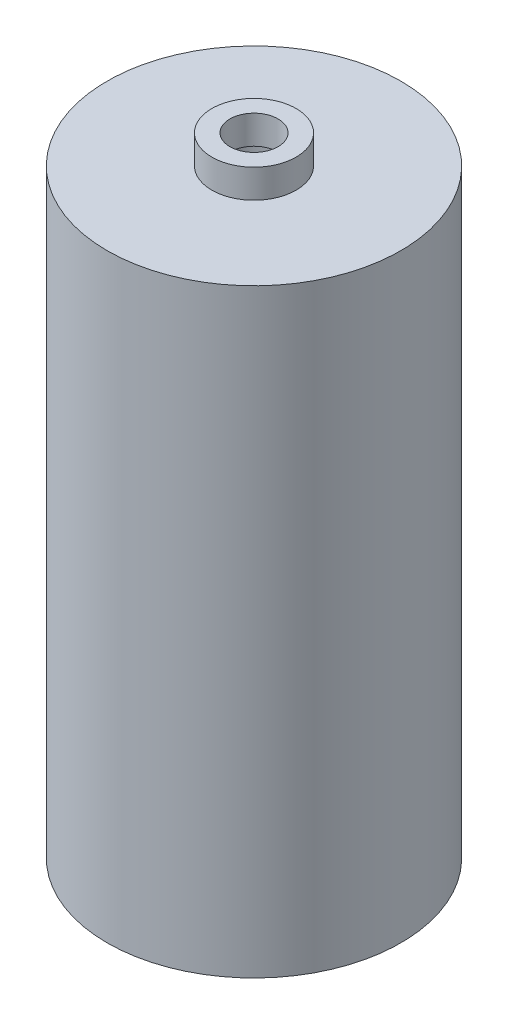
ISO-10303-21;
HEADER;
FILE_DESCRIPTION(('STEP AP214'),'2;1');
FILE_NAME('part.step','',(''),(''),'','','');
FILE_SCHEMA(('AUTOMOTIVE_DESIGN { 1 0 10303 214 1 1 1 1 }'));
ENDSEC;
DATA;
#1=APPLICATION_CONTEXT('core data for automotive mechanical design processes');
#2=APPLICATION_PROTOCOL_DEFINITION('international standard','automotive_design',2000,#1);
#3=PRODUCT_CONTEXT('',#1,'mechanical');
#4=PRODUCT('Part','Part','',(#3));
#5=PRODUCT_RELATED_PRODUCT_CATEGORY('part','',(#4));
#6=PRODUCT_DEFINITION_FORMATION('','',#4);
#7=PRODUCT_DEFINITION_CONTEXT('part definition',#1,'design');
#8=PRODUCT_DEFINITION('design','',#6,#7);
#9=PRODUCT_DEFINITION_SHAPE('','',#8);
#10=(LENGTH_UNIT() NAMED_UNIT(*) SI_UNIT(.MILLI.,.METRE.));
#11=(NAMED_UNIT(*) PLANE_ANGLE_UNIT() SI_UNIT($,.RADIAN.));
#12=(NAMED_UNIT(*) SI_UNIT($,.STERADIAN.) SOLID_ANGLE_UNIT());
#13=UNCERTAINTY_MEASURE_WITH_UNIT(LENGTH_MEASURE(1.E-05),#10,'distance_accuracy_value','');
#14=(GEOMETRIC_REPRESENTATION_CONTEXT(3) GLOBAL_UNCERTAINTY_ASSIGNED_CONTEXT((#13)) GLOBAL_UNIT_ASSIGNED_CONTEXT((#10,
#11,#12)) REPRESENTATION_CONTEXT('',''));
#15=CARTESIAN_POINT('',(0.,0.,0.));
#16=DIRECTION('',(0.,0.,1.));
#17=DIRECTION('',(1.,0.,0.));
#18=AXIS2_PLACEMENT_3D('',#15,#16,#17);
#19=CARTESIAN_POINT('',(0.,49.8,0.));
#20=DIRECTION('',(0.,1.,0.));
#21=DIRECTION('',(0.,0.,1.));
#22=AXIS2_PLACEMENT_3D('',#19,#20,#21);
#23=PLANE('',#22);
#24=CARTESIAN_POINT('',(0.,49.8,0.));
#25=DIRECTION('',(0.,1.,0.));
#26=DIRECTION('',(0.,0.,1.));
#27=AXIS2_PLACEMENT_3D('',#24,#25,#26);
#28=CIRCLE('',#27,3.5);
#29=CARTESIAN_POINT('',(0.,49.8,3.5));
#30=VERTEX_POINT('',#29);
#31=EDGE_CURVE('E72',#30,#30,#28,.T.);
#32=ORIENTED_EDGE('',*,*,#31,.F.);
#33=EDGE_LOOP('',(#32));
#34=FACE_BOUND('',#33,.T.);
#35=CARTESIAN_POINT('',(0.,49.8,0.));
#36=DIRECTION('',(0.,1.,0.));
#37=DIRECTION('',(0.,0.,1.));
#38=AXIS2_PLACEMENT_3D('',#35,#36,#37);
#39=CIRCLE('',#38,12.2);
#40=CARTESIAN_POINT('',(0.,49.8,12.2));
#41=VERTEX_POINT('',#40);
#42=EDGE_CURVE('E11',#41,#41,#39,.T.);
#43=ORIENTED_EDGE('',*,*,#42,.T.);
#44=EDGE_LOOP('',(#43));
#45=FACE_BOUND('',#44,.T.);
#46=ADVANCED_FACE('F49',(#34,#45),#23,.T.);
#47=CARTESIAN_POINT('',(0.,0.,0.));
#48=DIRECTION('',(0.,1.,0.));
#49=DIRECTION('',(0.,0.,1.));
#50=AXIS2_PLACEMENT_3D('',#47,#48,#49);
#51=PLANE('',#50);
#52=CARTESIAN_POINT('',(0.,0.,0.));
#53=DIRECTION('',(0.,1.,0.));
#54=DIRECTION('',(0.,0.,1.));
#55=AXIS2_PLACEMENT_3D('',#52,#53,#54);
#56=CIRCLE('',#55,12.2);
#57=CARTESIAN_POINT('',(0.,0.,12.2));
#58=VERTEX_POINT('',#57);
#59=EDGE_CURVE('E53',#58,#58,#56,.T.);
#60=ORIENTED_EDGE('',*,*,#59,.F.);
#61=EDGE_LOOP('',(#60));
#62=FACE_BOUND('',#61,.T.);
#63=CARTESIAN_POINT('',(0.,0.,0.));
#64=DIRECTION('',(0.,1.,0.));
#65=DIRECTION('',(0.,0.,1.));
#66=AXIS2_PLACEMENT_3D('',#63,#64,#65);
#67=CIRCLE('',#66,3.2);
#68=CARTESIAN_POINT('',(0.,0.,3.2));
#69=VERTEX_POINT('',#68);
#70=EDGE_CURVE('E62',#69,#69,#67,.T.);
#71=ORIENTED_EDGE('',*,*,#70,.T.);
#72=EDGE_LOOP('',(#71));
#73=FACE_BOUND('',#72,.T.);
#74=ADVANCED_FACE('F108',(#62,#73),#51,.F.);
#75=CARTESIAN_POINT('',(0.,49.8,0.));
#76=DIRECTION('',(0.,-1.,0.));
#77=DIRECTION('',(0.,0.,-1.));
#78=AXIS2_PLACEMENT_3D('',#75,#76,#77);
#79=CYLINDRICAL_SURFACE('',#78,12.2);
#80=ORIENTED_EDGE('',*,*,#42,.F.);
#81=EDGE_LOOP('',(#80));
#82=FACE_BOUND('',#81,.T.);
#83=ORIENTED_EDGE('',*,*,#59,.T.);
#84=EDGE_LOOP('',(#83));
#85=FACE_BOUND('',#84,.T.);
#86=ADVANCED_FACE('F51',(#82,#85),#79,.T.);
#87=CARTESIAN_POINT('',(0.,49.8,0.));
#88=DIRECTION('',(0.,-1.,0.));
#89=DIRECTION('',(0.,0.,-1.));
#90=AXIS2_PLACEMENT_3D('',#87,#88,#89);
#91=CYLINDRICAL_SURFACE('',#90,3.2);
#92=CARTESIAN_POINT('',(0.,49.8,0.));
#93=DIRECTION('',(0.,1.,0.));
#94=DIRECTION('',(0.,0.,1.));
#95=AXIS2_PLACEMENT_3D('',#92,#93,#94);
#96=CIRCLE('',#95,3.2);
#97=CARTESIAN_POINT('',(0.,49.8,3.2));
#98=VERTEX_POINT('',#97);
#99=EDGE_CURVE('E67',#98,#98,#96,.T.);
#100=ORIENTED_EDGE('',*,*,#99,.T.);
#101=EDGE_LOOP('',(#100));
#102=FACE_BOUND('',#101,.T.);
#103=ORIENTED_EDGE('',*,*,#70,.F.);
#104=EDGE_LOOP('',(#103));
#105=FACE_BOUND('',#104,.T.);
#106=ADVANCED_FACE('F103',(#102,#105),#91,.F.);
#107=CARTESIAN_POINT('',(0.,49.8,0.));
#108=DIRECTION('',(0.,1.,0.));
#109=DIRECTION('',(0.,0.,1.));
#110=AXIS2_PLACEMENT_3D('',#107,#108,#109);
#111=PLANE('',#110);
#112=CARTESIAN_POINT('',(0.,49.8,0.));
#113=DIRECTION('',(0.,1.,0.));
#114=DIRECTION('',(0.,0.,1.));
#115=AXIS2_PLACEMENT_3D('',#112,#113,#114);
#116=CIRCLE('',#115,2.);
#117=CARTESIAN_POINT('',(0.,49.8,2.));
#118=VERTEX_POINT('',#117);
#119=EDGE_CURVE('E80',#118,#118,#116,.T.);
#120=ORIENTED_EDGE('',*,*,#119,.T.);
#121=EDGE_LOOP('',(#120));
#122=FACE_BOUND('',#121,.T.);
#123=ORIENTED_EDGE('',*,*,#99,.F.);
#124=EDGE_LOOP('',(#123));
#125=FACE_BOUND('',#124,.T.);
#126=ADVANCED_FACE('F94',(#122,#125),#111,.F.);
#127=CARTESIAN_POINT('',(0.,52.18,0.));
#128=DIRECTION('',(0.,1.,0.));
#129=DIRECTION('',(0.,0.,1.));
#130=AXIS2_PLACEMENT_3D('',#127,#128,#129);
#131=PLANE('',#130);
#132=CARTESIAN_POINT('',(0.,52.18,0.));
#133=DIRECTION('',(0.,1.,0.));
#134=DIRECTION('',(0.,0.,1.));
#135=AXIS2_PLACEMENT_3D('',#132,#133,#134);
#136=CIRCLE('',#135,3.5);
#137=CARTESIAN_POINT('',(0.,52.18,3.5));
#138=VERTEX_POINT('',#137);
#139=EDGE_CURVE('E71',#138,#138,#136,.T.);
#140=ORIENTED_EDGE('',*,*,#139,.T.);
#141=EDGE_LOOP('',(#140));
#142=FACE_BOUND('',#141,.T.);
#143=CARTESIAN_POINT('',(0.,52.18,0.));
#144=DIRECTION('',(0.,1.,0.));
#145=DIRECTION('',(0.,0.,1.));
#146=AXIS2_PLACEMENT_3D('',#143,#144,#145);
#147=CIRCLE('',#146,2.);
#148=CARTESIAN_POINT('',(0.,52.18,2.));
#149=VERTEX_POINT('',#148);
#150=EDGE_CURVE('E76',#149,#149,#147,.T.);
#151=ORIENTED_EDGE('',*,*,#150,.F.);
#152=EDGE_LOOP('',(#151));
#153=FACE_BOUND('',#152,.T.);
#154=ADVANCED_FACE('F91',(#142,#153),#131,.T.);
#155=CARTESIAN_POINT('',(0.,52.18,0.));
#156=DIRECTION('',(0.,-1.,0.));
#157=DIRECTION('',(0.,0.,-1.));
#158=AXIS2_PLACEMENT_3D('',#155,#156,#157);
#159=CYLINDRICAL_SURFACE('',#158,3.5);
#160=ORIENTED_EDGE('',*,*,#139,.F.);
#161=EDGE_LOOP('',(#160));
#162=FACE_BOUND('',#161,.T.);
#163=ORIENTED_EDGE('',*,*,#31,.T.);
#164=EDGE_LOOP('',(#163));
#165=FACE_BOUND('',#164,.T.);
#166=ADVANCED_FACE('F93',(#162,#165),#159,.T.);
#167=CARTESIAN_POINT('',(0.,52.18,0.));
#168=DIRECTION('',(0.,-1.,0.));
#169=DIRECTION('',(0.,0.,-1.));
#170=AXIS2_PLACEMENT_3D('',#167,#168,#169);
#171=CYLINDRICAL_SURFACE('',#170,2.);
#172=ORIENTED_EDGE('',*,*,#150,.T.);
#173=EDGE_LOOP('',(#172));
#174=FACE_BOUND('',#173,.T.);
#175=ORIENTED_EDGE('',*,*,#119,.F.);
#176=EDGE_LOOP('',(#175));
#177=FACE_BOUND('',#176,.T.);
#178=ADVANCED_FACE('F88',(#174,#177),#171,.F.);
#179=CLOSED_SHELL('',(#46,#74,#86,#106,#126,#154,#166,#178));
#180=MANIFOLD_SOLID_BREP('B2',#179);
#181=ADVANCED_BREP_SHAPE_REPRESENTATION('',(#18,#180),#14);
#182=SHAPE_DEFINITION_REPRESENTATION(#9,#181);
ENDSEC;
END-ISO-10303-21;
